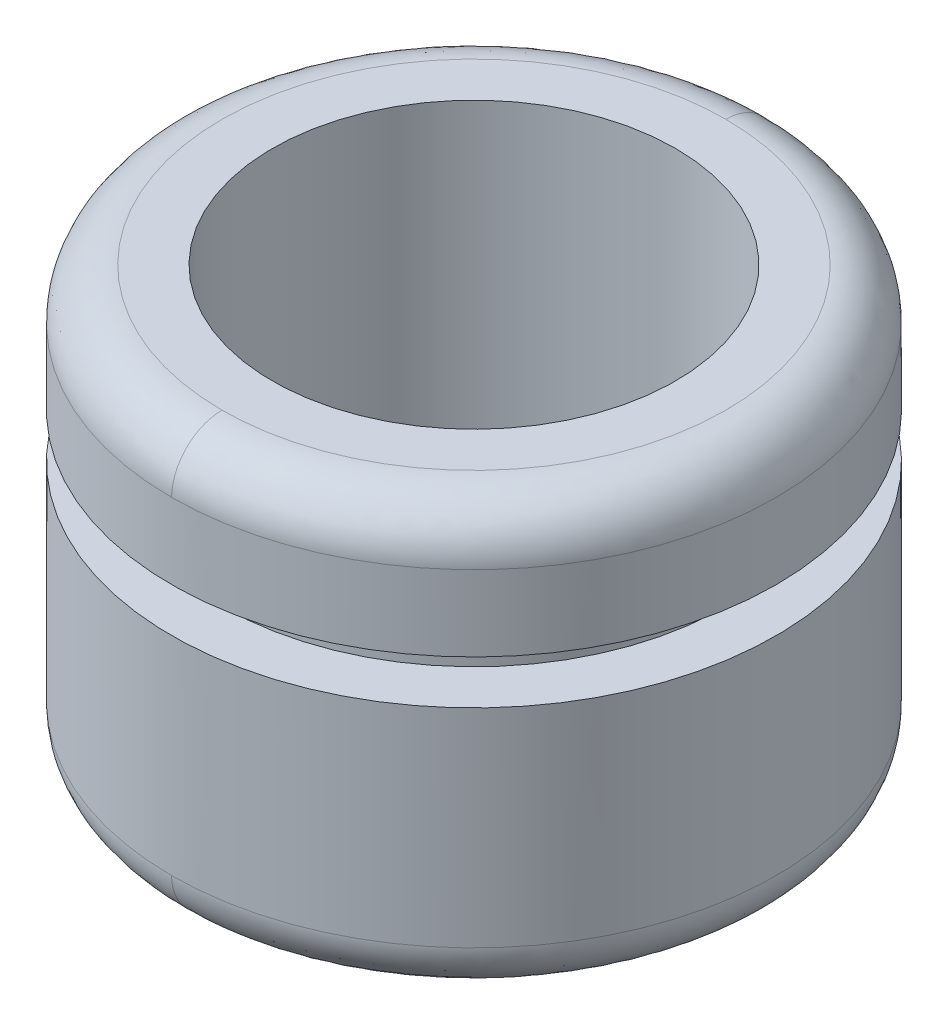
ISO-10303-21;
HEADER;
FILE_DESCRIPTION(('STEP AP214'),'2;1');
FILE_NAME('part.step','',(''),(''),'','','');
FILE_SCHEMA(('AUTOMOTIVE_DESIGN { 1 0 10303 214 1 1 1 1 }'));
ENDSEC;
DATA;
#1=APPLICATION_CONTEXT('core data for automotive mechanical design processes');
#2=APPLICATION_PROTOCOL_DEFINITION('international standard','automotive_design',2000,#1);
#3=PRODUCT_CONTEXT('',#1,'mechanical');
#4=PRODUCT('Part','Part','',(#3));
#5=PRODUCT_RELATED_PRODUCT_CATEGORY('part','',(#4));
#6=PRODUCT_DEFINITION_FORMATION('','',#4);
#7=PRODUCT_DEFINITION_CONTEXT('part definition',#1,'design');
#8=PRODUCT_DEFINITION('design','',#6,#7);
#9=PRODUCT_DEFINITION_SHAPE('','',#8);
#10=(LENGTH_UNIT() NAMED_UNIT(*) SI_UNIT(.MILLI.,.METRE.));
#11=(NAMED_UNIT(*) PLANE_ANGLE_UNIT() SI_UNIT($,.RADIAN.));
#12=(NAMED_UNIT(*) SI_UNIT($,.STERADIAN.) SOLID_ANGLE_UNIT());
#13=UNCERTAINTY_MEASURE_WITH_UNIT(LENGTH_MEASURE(1.E-05),#10,'distance_accuracy_value','');
#14=(GEOMETRIC_REPRESENTATION_CONTEXT(3) GLOBAL_UNCERTAINTY_ASSIGNED_CONTEXT((#13)) GLOBAL_UNIT_ASSIGNED_CONTEXT((#10,
#11,#12)) REPRESENTATION_CONTEXT('',''));
#15=CARTESIAN_POINT('',(0.,0.,0.));
#16=DIRECTION('',(0.,0.,1.));
#17=DIRECTION('',(1.,0.,0.));
#18=AXIS2_PLACEMENT_3D('',#15,#16,#17);
#19=CARTESIAN_POINT('',(0.,10.25,0.));
#20=DIRECTION('',(0.,-1.,0.));
#21=DIRECTION('',(0.,0.,-1.));
#22=AXIS2_PLACEMENT_3D('',#19,#20,#21);
#23=CYLINDRICAL_SURFACE('',#22,12.);
#24=CARTESIAN_POINT('',(0.,10.25,0.));
#25=DIRECTION('',(0.,-1.,0.));
#26=DIRECTION('',(0.,0.,-1.));
#27=AXIS2_PLACEMENT_3D('',#24,#25,#26);
#28=CIRCLE('',#27,12.);
#29=CARTESIAN_POINT('',(0.,10.25,-12.));
#30=VERTEX_POINT('',#29);
#31=EDGE_CURVE('E22',#30,#30,#28,.F.);
#32=ORIENTED_EDGE('',*,*,#31,.F.);
#33=EDGE_LOOP('',(#32));
#34=FACE_BOUND('',#33,.T.);
#35=CARTESIAN_POINT('',(0.,1.99999999888262,0.));
#36=DIRECTION('',(0.,-1.,0.));
#37=DIRECTION('',(1.,0.,0.));
#38=AXIS2_PLACEMENT_3D('',#35,#36,#37);
#39=CIRCLE('',#38,12.0000000003185);
#40=CARTESIAN_POINT('',(-5.38761770572398E-10,1.99999999916196,-12.0000000002389));
#41=VERTEX_POINT('',#40);
#42=CARTESIAN_POINT('',(-1.23062057109199E-09,1.99999999888262,12.0000000002389));
#43=VERTEX_POINT('',#42);
#44=EDGE_CURVE('E57',#41,#43,#39,.T.);
#45=ORIENTED_EDGE('',*,*,#44,.F.);
#46=CARTESIAN_POINT('',(0.,1.99999999888262,0.));
#47=DIRECTION('',(0.,-1.,0.));
#48=DIRECTION('',(1.,0.,0.));
#49=AXIS2_PLACEMENT_3D('',#46,#47,#48);
#50=CIRCLE('',#49,12.0000000003185);
#51=EDGE_CURVE('E61',#43,#41,#50,.T.);
#52=ORIENTED_EDGE('',*,*,#51,.F.);
#53=EDGE_LOOP('',(#45,#52));
#54=FACE_BOUND('',#53,.T.);
#55=ADVANCED_FACE('F17',(#34,#54),#23,.T.);
#56=CARTESIAN_POINT('',(-12.144,10.25,-12.144));
#57=DIRECTION('',(0.,1.,0.));
#58=DIRECTION('',(0.,0.,1.));
#59=AXIS2_PLACEMENT_3D('',#56,#57,#58);
#60=PLANE('',#59);
#61=CARTESIAN_POINT('',(0.,10.25,0.));
#62=DIRECTION('',(0.,-1.,0.));
#63=DIRECTION('',(0.,0.,-1.));
#64=AXIS2_PLACEMENT_3D('',#61,#62,#63);
#65=CIRCLE('',#64,10.);
#66=CARTESIAN_POINT('',(0.,10.25,-10.));
#67=VERTEX_POINT('',#66);
#68=EDGE_CURVE('E74',#67,#67,#65,.T.);
#69=ORIENTED_EDGE('',*,*,#68,.T.);
#70=EDGE_LOOP('',(#69));
#71=FACE_BOUND('',#70,.T.);
#72=ORIENTED_EDGE('',*,*,#31,.T.);
#73=EDGE_LOOP('',(#72));
#74=FACE_BOUND('',#73,.T.);
#75=ADVANCED_FACE('F103',(#71,#74),#60,.T.);
#76=CARTESIAN_POINT('',(0.,0.009991669,-9.800333167));
#77=CARTESIAN_POINT('',(19.600666333,0.009991669,-9.800333167));
#78=CARTESIAN_POINT('',(19.600666333,0.009991669,9.800333167));
#79=CARTESIAN_POINT('',(0.,0.009991669,9.800333167));
#80=CARTESIAN_POINT('',(0.,-0.126440845,-11.16010753));
#81=CARTESIAN_POINT('',(22.320215061,-0.126440845,-11.16010753));
#82=CARTESIAN_POINT('',(22.320215061,-0.126440845,11.16010753));
#83=CARTESIAN_POINT('',(0.,-0.126440845,11.16010753));
#84=CARTESIAN_POINT('',(0.,0.83989247,-12.126440845));
#85=CARTESIAN_POINT('',(24.252881691,0.83989247,-12.126440845));
#86=CARTESIAN_POINT('',(24.252881691,0.83989247,12.126440845));
#87=CARTESIAN_POINT('',(0.,0.83989247,12.126440845));
#88=CARTESIAN_POINT('',(0.,2.199666833,-11.990008331));
#89=CARTESIAN_POINT('',(23.980016661,2.199666833,-11.990008331));
#90=CARTESIAN_POINT('',(23.980016661,2.199666833,11.990008331));
#91=CARTESIAN_POINT('',(0.,2.199666833,11.990008331));
#92=(BOUNDED_SURFACE() B_SPLINE_SURFACE(3,3,((#76,#77,#78,#79),(#80,#81,#82,#83),(#84,#85,#86,
#87),(#88,#89,#90,#91)),.UNSPECIFIED.,.F.,.F.,.F.) B_SPLINE_SURFACE_WITH_KNOTS((4,4),(4,4),(0.,
1.),(0.,1.),.UNSPECIFIED.) GEOMETRIC_REPRESENTATION_ITEM() RATIONAL_B_SPLINE_SURFACE(((1.,
0.333333333333333,0.333333333333333,1.),(0.755320871117972,0.251773623705991,0.251773623705991,
0.755320871117972),(0.755320871117972,0.251773623705991,0.251773623705991,0.755320871117972),
(1.,0.333333333333333,0.333333333333333,1.))) REPRESENTATION_ITEM('') SURFACE());
#93=CARTESIAN_POINT('',(0.,-3.18488293810218E-10,10.0000000012986));
#94=CARTESIAN_POINT('',(20.0000000018775,-3.1848831384993E-10,10.0000000012986));
#95=CARTESIAN_POINT('',(20.0000000018775,-3.1848831384993E-10,-10.0000000012986));
#96=CARTESIAN_POINT('',(0.,-3.18488293810218E-10,-10.0000000012986));
#97=(BOUNDED_CURVE() B_SPLINE_CURVE(3,(#93,#94,#95,#96),.UNSPECIFIED.,.F.,
.F.) B_SPLINE_CURVE_WITH_KNOTS((4,4),(0.,1.),
.UNSPECIFIED.) CURVE() GEOMETRIC_REPRESENTATION_ITEM() RATIONAL_B_SPLINE_CURVE((0.956578302130087,
0.318859434043362,0.318859434043362,0.956578302130087)) REPRESENTATION_ITEM(''));
#98=CARTESIAN_POINT('',(0.,-1.9109297562994E-10,-9.99999999875893));
#99=VERTEX_POINT('',#98);
#100=CARTESIAN_POINT('',(0.,-1.9109297562994E-10,9.99999999875893));
#101=VERTEX_POINT('',#100);
#102=EDGE_CURVE('E69',#99,#101,#97,.F.);
#103=CARTESIAN_POINT('',(0.,0.009991669,-9.800333167));
#104=CARTESIAN_POINT('',(0.,-0.126440845,-11.16010753));
#105=CARTESIAN_POINT('',(0.,0.83989247,-12.126440845));
#106=CARTESIAN_POINT('',(0.,2.199666833,-11.990008331));
#107=(BOUNDED_CURVE() B_SPLINE_CURVE(3,(#103,#104,#105,#106),.UNSPECIFIED.,.F.,
.F.) B_SPLINE_CURVE_WITH_KNOTS((4,4),(0.,1.),
.UNSPECIFIED.) CURVE() GEOMETRIC_REPRESENTATION_ITEM() RATIONAL_B_SPLINE_CURVE((1.,
0.755320871117972,0.755320871117972,1.)) REPRESENTATION_ITEM(''));
#108=EDGE_CURVE('E66',#41,#99,#107,.F.);
#109=CARTESIAN_POINT('',(0.,0.009991669,9.800333167));
#110=CARTESIAN_POINT('',(0.,-0.126440845,11.16010753));
#111=CARTESIAN_POINT('',(0.,0.83989247,12.126440845));
#112=CARTESIAN_POINT('',(0.,2.199666833,11.990008331));
#113=(BOUNDED_CURVE() B_SPLINE_CURVE(3,(#109,#110,#111,#112),.UNSPECIFIED.,.F.,
.F.) B_SPLINE_CURVE_WITH_KNOTS((4,4),(0.,1.),
.UNSPECIFIED.) CURVE() GEOMETRIC_REPRESENTATION_ITEM() RATIONAL_B_SPLINE_CURVE((1.,
0.755320871117972,0.755320871117972,1.)) REPRESENTATION_ITEM(''));
#114=EDGE_CURVE('E63',#101,#43,#113,.T.);
#115=ORIENTED_EDGE('',*,*,#102,.F.);
#116=ORIENTED_EDGE('',*,*,#108,.F.);
#117=ORIENTED_EDGE('',*,*,#44,.T.);
#118=ORIENTED_EDGE('',*,*,#114,.F.);
#119=EDGE_LOOP('',(#115,#116,#117,#118));
#120=FACE_BOUND('',#119,.T.);
#121=ADVANCED_FACE('F67',(#120),#92,.T.);
#122=CARTESIAN_POINT('',(0.,0.009991669,9.800333167));
#123=CARTESIAN_POINT('',(-19.600666333,0.009991669,9.800333167));
#124=CARTESIAN_POINT('',(-19.600666333,0.009991669,-9.800333167));
#125=CARTESIAN_POINT('',(0.,0.009991669,-9.800333167));
#126=CARTESIAN_POINT('',(0.,-0.126440845,11.16010753));
#127=CARTESIAN_POINT('',(-22.320215061,-0.126440845,11.16010753));
#128=CARTESIAN_POINT('',(-22.320215061,-0.126440845,-11.16010753));
#129=CARTESIAN_POINT('',(0.,-0.126440845,-11.16010753));
#130=CARTESIAN_POINT('',(0.,0.83989247,12.126440845));
#131=CARTESIAN_POINT('',(-24.252881691,0.83989247,12.126440845));
#132=CARTESIAN_POINT('',(-24.252881691,0.83989247,-12.126440845));
#133=CARTESIAN_POINT('',(0.,0.83989247,-12.126440845));
#134=CARTESIAN_POINT('',(0.,2.199666833,11.990008331));
#135=CARTESIAN_POINT('',(-23.980016661,2.199666833,11.990008331));
#136=CARTESIAN_POINT('',(-23.980016661,2.199666833,-11.990008331));
#137=CARTESIAN_POINT('',(0.,2.199666833,-11.990008331));
#138=(BOUNDED_SURFACE() B_SPLINE_SURFACE(3,3,((#122,#123,#124,#125),(#126,#127,#128,#129),(#130,
#131,#132,#133),(#134,#135,#136,#137)),.UNSPECIFIED.,.F.,.F.,
.F.) B_SPLINE_SURFACE_WITH_KNOTS((4,4),(4,4),(0.,1.),(0.,1.),
.UNSPECIFIED.) GEOMETRIC_REPRESENTATION_ITEM() RATIONAL_B_SPLINE_SURFACE(((1.,0.333333333333333,
0.333333333333333,1.),(0.755320871117972,0.251773623705991,0.251773623705991,0.755320871117972),
(0.755320871117972,0.251773623705991,0.251773623705991,0.755320871117972),(1.,0.333333333333333,
0.333333333333333,1.))) REPRESENTATION_ITEM('') SURFACE());
#139=CARTESIAN_POINT('',(0.,-3.18488293078145E-10,-10.0000000012986));
#140=CARTESIAN_POINT('',(-20.0000000018775,-3.18488312654322E-10,-10.0000000012986));
#141=CARTESIAN_POINT('',(-20.0000000018775,-3.18488312654322E-10,10.0000000012986));
#142=CARTESIAN_POINT('',(0.,-3.18488293078145E-10,10.0000000012986));
#143=(BOUNDED_CURVE() B_SPLINE_CURVE(3,(#139,#140,#141,#142),.UNSPECIFIED.,.F.,
.F.) B_SPLINE_CURVE_WITH_KNOTS((4,4),(0.,1.),
.UNSPECIFIED.) CURVE() GEOMETRIC_REPRESENTATION_ITEM() RATIONAL_B_SPLINE_CURVE((0.956578302130087,
0.318859434043362,0.318859434043362,0.956578302130087)) REPRESENTATION_ITEM(''));
#144=EDGE_CURVE('E145',#101,#99,#143,.F.);
#145=ORIENTED_EDGE('',*,*,#108,.T.);
#146=ORIENTED_EDGE('',*,*,#144,.F.);
#147=ORIENTED_EDGE('',*,*,#114,.T.);
#148=ORIENTED_EDGE('',*,*,#51,.T.);
#149=EDGE_LOOP('',(#145,#146,#147,#148));
#150=FACE_BOUND('',#149,.T.);
#151=ADVANCED_FACE('F76',(#150),#138,.T.);
#152=CARTESIAN_POINT('',(0.,12.,0.));
#153=DIRECTION('',(0.,-1.,0.));
#154=DIRECTION('',(0.,0.,-1.));
#155=AXIS2_PLACEMENT_3D('',#152,#153,#154);
#156=CYLINDRICAL_SURFACE('',#155,10.);
#157=CARTESIAN_POINT('',(0.,12.,0.));
#158=DIRECTION('',(0.,-1.,0.));
#159=DIRECTION('',(0.,0.,-1.));
#160=AXIS2_PLACEMENT_3D('',#157,#158,#159);
#161=CIRCLE('',#160,10.);
#162=CARTESIAN_POINT('',(0.,12.,-10.));
#163=VERTEX_POINT('',#162);
#164=EDGE_CURVE('E143',#163,#163,#161,.F.);
#165=ORIENTED_EDGE('',*,*,#164,.F.);
#166=EDGE_LOOP('',(#165));
#167=FACE_BOUND('',#166,.T.);
#168=ORIENTED_EDGE('',*,*,#68,.F.);
#169=EDGE_LOOP('',(#168));
#170=FACE_BOUND('',#169,.T.);
#171=ADVANCED_FACE('F101',(#167,#170),#156,.T.);
#172=CARTESIAN_POINT('',(-10.12,0.,10.12));
#173=DIRECTION('',(0.,-1.,0.));
#174=DIRECTION('',(0.,0.,-1.));
#175=AXIS2_PLACEMENT_3D('',#172,#173,#174);
#176=PLANE('',#175);
#177=CARTESIAN_POINT('',(0.,0.,0.));
#178=DIRECTION('',(0.,-1.,0.));
#179=DIRECTION('',(0.,0.,-1.));
#180=AXIS2_PLACEMENT_3D('',#177,#178,#179);
#181=CIRCLE('',#180,8.);
#182=CARTESIAN_POINT('',(0.,0.,-8.));
#183=VERTEX_POINT('',#182);
#184=EDGE_CURVE('E140',#183,#183,#181,.T.);
#185=ORIENTED_EDGE('',*,*,#184,.F.);
#186=EDGE_LOOP('',(#185));
#187=FACE_BOUND('',#186,.T.);
#188=ORIENTED_EDGE('',*,*,#102,.T.);
#189=ORIENTED_EDGE('',*,*,#144,.T.);
#190=EDGE_LOOP('',(#188,#189));
#191=FACE_BOUND('',#190,.T.);
#192=ADVANCED_FACE('F91',(#187,#191),#176,.T.);
#193=CARTESIAN_POINT('',(-12.144,12.,12.144));
#194=DIRECTION('',(0.,-1.,0.));
#195=DIRECTION('',(0.,0.,-1.));
#196=AXIS2_PLACEMENT_3D('',#193,#194,#195);
#197=PLANE('',#196);
#198=ORIENTED_EDGE('',*,*,#164,.T.);
#199=EDGE_LOOP('',(#198));
#200=FACE_BOUND('',#199,.T.);
#201=CARTESIAN_POINT('',(0.,12.,0.));
#202=DIRECTION('',(0.,-1.,0.));
#203=DIRECTION('',(1.,0.,0.));
#204=AXIS2_PLACEMENT_3D('',#201,#202,#203);
#205=CIRCLE('',#204,12.);
#206=CARTESIAN_POINT('',(12.,12.,0.));
#207=VERTEX_POINT('',#206);
#208=EDGE_CURVE('E137',#207,#207,#205,.T.);
#209=ORIENTED_EDGE('',*,*,#208,.T.);
#210=EDGE_LOOP('',(#209));
#211=FACE_BOUND('',#210,.T.);
#212=ADVANCED_FACE('F100',(#200,#211),#197,.T.);
#213=CARTESIAN_POINT('',(0.,17.,0.));
#214=DIRECTION('',(0.,-1.,0.));
#215=DIRECTION('',(0.,0.,-1.));
#216=AXIS2_PLACEMENT_3D('',#213,#214,#215);
#217=CYLINDRICAL_SURFACE('',#216,8.);
#218=ORIENTED_EDGE('',*,*,#184,.T.);
#219=EDGE_LOOP('',(#218));
#220=FACE_BOUND('',#219,.T.);
#221=CARTESIAN_POINT('',(0.,17.,0.));
#222=DIRECTION('',(0.,-1.,0.));
#223=DIRECTION('',(0.,0.,-1.));
#224=AXIS2_PLACEMENT_3D('',#221,#222,#223);
#225=CIRCLE('',#224,8.);
#226=CARTESIAN_POINT('',(0.,17.,-8.));
#227=VERTEX_POINT('',#226);
#228=EDGE_CURVE('E128',#227,#227,#225,.T.);
#229=ORIENTED_EDGE('',*,*,#228,.F.);
#230=EDGE_LOOP('',(#229));
#231=FACE_BOUND('',#230,.T.);
#232=ADVANCED_FACE('F273',(#220,#231),#217,.F.);
#233=CARTESIAN_POINT('',(0.,15.,0.));
#234=DIRECTION('',(0.,-1.,0.));
#235=DIRECTION('',(1.,0.,0.));
#236=AXIS2_PLACEMENT_3D('',#233,#234,#235);
#237=CYLINDRICAL_SURFACE('',#236,12.);
#238=ORIENTED_EDGE('',*,*,#208,.F.);
#239=EDGE_LOOP('',(#238));
#240=FACE_BOUND('',#239,.T.);
#241=CARTESIAN_POINT('',(0.,15.0000000011174,0.));
#242=DIRECTION('',(0.,1.,0.));
#243=DIRECTION('',(-1.,0.,0.));
#244=AXIS2_PLACEMENT_3D('',#241,#242,#243);
#245=CIRCLE('',#244,12.0000000003185);
#246=CARTESIAN_POINT('',(-1.23062057109199E-09,15.0000000011174,12.0000000002389));
#247=VERTEX_POINT('',#246);
#248=CARTESIAN_POINT('',(0.,15.000000000838,-12.0000000002389));
#249=VERTEX_POINT('',#248);
#250=EDGE_CURVE('E247',#247,#249,#245,.T.);
#251=ORIENTED_EDGE('',*,*,#250,.F.);
#252=CARTESIAN_POINT('',(0.,15.0000000011174,0.));
#253=DIRECTION('',(0.,1.,0.));
#254=DIRECTION('',(-1.,0.,0.));
#255=AXIS2_PLACEMENT_3D('',#252,#253,#254);
#256=CIRCLE('',#255,12.0000000003185);
#257=EDGE_CURVE('E136',#249,#247,#256,.T.);
#258=ORIENTED_EDGE('',*,*,#257,.F.);
#259=EDGE_LOOP('',(#251,#258));
#260=FACE_BOUND('',#259,.T.);
#261=ADVANCED_FACE('F271',(#240,#260),#237,.T.);
#262=CARTESIAN_POINT('',(-10.12,17.,-10.12));
#263=DIRECTION('',(0.,1.,0.));
#264=DIRECTION('',(0.,0.,1.));
#265=AXIS2_PLACEMENT_3D('',#262,#263,#264);
#266=PLANE('',#265);
#267=ORIENTED_EDGE('',*,*,#228,.T.);
#268=EDGE_LOOP('',(#267));
#269=FACE_BOUND('',#268,.T.);
#270=CARTESIAN_POINT('',(0.,17.0000000003185,-10.0000000012986));
#271=CARTESIAN_POINT('',(20.0000000018775,17.0000000003185,-10.0000000012986));
#272=CARTESIAN_POINT('',(20.0000000018775,17.0000000003185,10.0000000012986));
#273=CARTESIAN_POINT('',(0.,17.0000000003185,10.0000000012986));
#274=(BOUNDED_CURVE() B_SPLINE_CURVE(3,(#270,#271,#272,#273),.UNSPECIFIED.,.F.,
.F.) B_SPLINE_CURVE_WITH_KNOTS((4,4),(0.,1.),
.UNSPECIFIED.) CURVE() GEOMETRIC_REPRESENTATION_ITEM() RATIONAL_B_SPLINE_CURVE((0.956578302130087,
0.318859434043362,0.318859434043362,0.956578302130087)) REPRESENTATION_ITEM(''));
#275=CARTESIAN_POINT('',(0.,17.0000000001911,-9.99999999875893));
#276=VERTEX_POINT('',#275);
#277=CARTESIAN_POINT('',(0.,17.0000000001911,9.99999999875893));
#278=VERTEX_POINT('',#277);
#279=EDGE_CURVE('E28',#276,#278,#274,.T.);
#280=ORIENTED_EDGE('',*,*,#279,.F.);
#281=CARTESIAN_POINT('',(0.,17.0000000003185,10.0000000012986));
#282=CARTESIAN_POINT('',(-20.0000000018775,17.0000000003185,10.0000000012986));
#283=CARTESIAN_POINT('',(-20.0000000018775,17.0000000003185,-10.0000000012986));
#284=CARTESIAN_POINT('',(0.,17.0000000003185,-10.0000000012986));
#285=(BOUNDED_CURVE() B_SPLINE_CURVE(3,(#281,#282,#283,#284),.UNSPECIFIED.,.F.,
.F.) B_SPLINE_CURVE_WITH_KNOTS((4,4),(0.,1.),
.UNSPECIFIED.) CURVE() GEOMETRIC_REPRESENTATION_ITEM() RATIONAL_B_SPLINE_CURVE((0.956578302130087,
0.318859434043362,0.318859434043362,0.956578302130087)) REPRESENTATION_ITEM(''));
#286=EDGE_CURVE('E36',#278,#276,#285,.T.);
#287=ORIENTED_EDGE('',*,*,#286,.F.);
#288=EDGE_LOOP('',(#280,#287));
#289=FACE_BOUND('',#288,.T.);
#290=ADVANCED_FACE('F19',(#269,#289),#266,.T.);
#291=CARTESIAN_POINT('',(0.,16.990008331,-9.800333167));
#292=CARTESIAN_POINT('',(-19.600666333,16.990008331,-9.800333167));
#293=CARTESIAN_POINT('',(-19.600666333,16.990008331,9.800333167));
#294=CARTESIAN_POINT('',(0.,16.990008331,9.800333167));
#295=CARTESIAN_POINT('',(0.,17.126440845,-11.16010753));
#296=CARTESIAN_POINT('',(-22.320215061,17.126440845,-11.16010753));
#297=CARTESIAN_POINT('',(-22.320215061,17.126440845,11.16010753));
#298=CARTESIAN_POINT('',(0.,17.126440845,11.16010753));
#299=CARTESIAN_POINT('',(0.,16.16010753,-12.126440845));
#300=CARTESIAN_POINT('',(-24.252881691,16.16010753,-12.126440845));
#301=CARTESIAN_POINT('',(-24.252881691,16.16010753,12.126440845));
#302=CARTESIAN_POINT('',(0.,16.16010753,12.126440845));
#303=CARTESIAN_POINT('',(0.,14.800333167,-11.990008331));
#304=CARTESIAN_POINT('',(-23.980016661,14.800333167,-11.990008331));
#305=CARTESIAN_POINT('',(-23.980016661,14.800333167,11.990008331));
#306=CARTESIAN_POINT('',(0.,14.800333167,11.990008331));
#307=(BOUNDED_SURFACE() B_SPLINE_SURFACE(3,3,((#291,#292,#293,#294),(#295,#296,#297,#298),(#299,
#300,#301,#302),(#303,#304,#305,#306)),.UNSPECIFIED.,.F.,.F.,
.F.) B_SPLINE_SURFACE_WITH_KNOTS((4,4),(4,4),(0.,1.),(0.,1.),
.UNSPECIFIED.) GEOMETRIC_REPRESENTATION_ITEM() RATIONAL_B_SPLINE_SURFACE(((1.,0.333333333333333,
0.333333333333333,1.),(0.755320871117972,0.251773623705991,0.251773623705991,0.755320871117972),
(0.755320871117972,0.251773623705991,0.251773623705991,0.755320871117972),(1.,0.333333333333333,
0.333333333333333,1.))) REPRESENTATION_ITEM('') SURFACE());
#308=CARTESIAN_POINT('',(0.,16.990008331,9.800333167));
#309=CARTESIAN_POINT('',(0.,17.126440845,11.16010753));
#310=CARTESIAN_POINT('',(0.,16.16010753,12.126440845));
#311=CARTESIAN_POINT('',(0.,14.800333167,11.990008331));
#312=(BOUNDED_CURVE() B_SPLINE_CURVE(3,(#308,#309,#310,#311),.UNSPECIFIED.,.F.,
.F.) B_SPLINE_CURVE_WITH_KNOTS((4,4),(0.,1.),
.UNSPECIFIED.) CURVE() GEOMETRIC_REPRESENTATION_ITEM() RATIONAL_B_SPLINE_CURVE((1.,
0.755320871117972,0.755320871117972,1.)) REPRESENTATION_ITEM(''));
#313=EDGE_CURVE('E11',#278,#247,#312,.T.);
#314=CARTESIAN_POINT('',(0.,16.990008331,-9.800333167));
#315=CARTESIAN_POINT('',(0.,17.126440845,-11.16010753));
#316=CARTESIAN_POINT('',(0.,16.16010753,-12.126440845));
#317=CARTESIAN_POINT('',(0.,14.800333167,-11.990008331));
#318=(BOUNDED_CURVE() B_SPLINE_CURVE(3,(#314,#315,#316,#317),.UNSPECIFIED.,.F.,
.F.) B_SPLINE_CURVE_WITH_KNOTS((4,4),(0.,1.),
.UNSPECIFIED.) CURVE() GEOMETRIC_REPRESENTATION_ITEM() RATIONAL_B_SPLINE_CURVE((1.,
0.755320871117972,0.755320871117972,1.)) REPRESENTATION_ITEM(''));
#319=EDGE_CURVE('E240',#249,#276,#318,.F.);
#320=ORIENTED_EDGE('',*,*,#313,.F.);
#321=ORIENTED_EDGE('',*,*,#286,.T.);
#322=ORIENTED_EDGE('',*,*,#319,.F.);
#323=ORIENTED_EDGE('',*,*,#257,.T.);
#324=EDGE_LOOP('',(#320,#321,#322,#323));
#325=FACE_BOUND('',#324,.T.);
#326=ADVANCED_FACE('F216',(#325),#307,.T.);
#327=CARTESIAN_POINT('',(0.,16.990008331,9.800333167));
#328=CARTESIAN_POINT('',(19.600666333,16.990008331,9.800333167));
#329=CARTESIAN_POINT('',(19.600666333,16.990008331,-9.800333167));
#330=CARTESIAN_POINT('',(0.,16.990008331,-9.800333167));
#331=CARTESIAN_POINT('',(0.,17.126440845,11.16010753));
#332=CARTESIAN_POINT('',(22.320215061,17.126440845,11.16010753));
#333=CARTESIAN_POINT('',(22.320215061,17.126440845,-11.16010753));
#334=CARTESIAN_POINT('',(0.,17.126440845,-11.16010753));
#335=CARTESIAN_POINT('',(0.,16.16010753,12.126440845));
#336=CARTESIAN_POINT('',(24.252881691,16.16010753,12.126440845));
#337=CARTESIAN_POINT('',(24.252881691,16.16010753,-12.126440845));
#338=CARTESIAN_POINT('',(0.,16.16010753,-12.126440845));
#339=CARTESIAN_POINT('',(0.,14.800333167,11.990008331));
#340=CARTESIAN_POINT('',(23.980016661,14.800333167,11.990008331));
#341=CARTESIAN_POINT('',(23.980016661,14.800333167,-11.990008331));
#342=CARTESIAN_POINT('',(0.,14.800333167,-11.990008331));
#343=(BOUNDED_SURFACE() B_SPLINE_SURFACE(3,3,((#327,#328,#329,#330),(#331,#332,#333,#334),(#335,
#336,#337,#338),(#339,#340,#341,#342)),.UNSPECIFIED.,.F.,.F.,
.F.) B_SPLINE_SURFACE_WITH_KNOTS((4,4),(4,4),(0.,1.),(0.,1.),
.UNSPECIFIED.) GEOMETRIC_REPRESENTATION_ITEM() RATIONAL_B_SPLINE_SURFACE(((1.,0.333333333333333,
0.333333333333333,1.),(0.755320871117972,0.251773623705991,0.251773623705991,0.755320871117972),
(0.755320871117972,0.251773623705991,0.251773623705991,0.755320871117972),(1.,0.333333333333333,
0.333333333333333,1.))) REPRESENTATION_ITEM('') SURFACE());
#344=ORIENTED_EDGE('',*,*,#279,.T.);
#345=ORIENTED_EDGE('',*,*,#313,.T.);
#346=ORIENTED_EDGE('',*,*,#250,.T.);
#347=ORIENTED_EDGE('',*,*,#319,.T.);
#348=EDGE_LOOP('',(#344,#345,#346,#347));
#349=FACE_BOUND('',#348,.T.);
#350=ADVANCED_FACE('F214',(#349),#343,.T.);
#351=CLOSED_SHELL('',(#55,#75,#121,#151,#171,#192,#212,#232,#261,#290,#326,#350));
#352=MANIFOLD_SOLID_BREP('B1',#351);
#353=ADVANCED_BREP_SHAPE_REPRESENTATION('',(#18,#352),#14);
#354=SHAPE_DEFINITION_REPRESENTATION(#9,#353);
ENDSEC;
END-ISO-10303-21;
